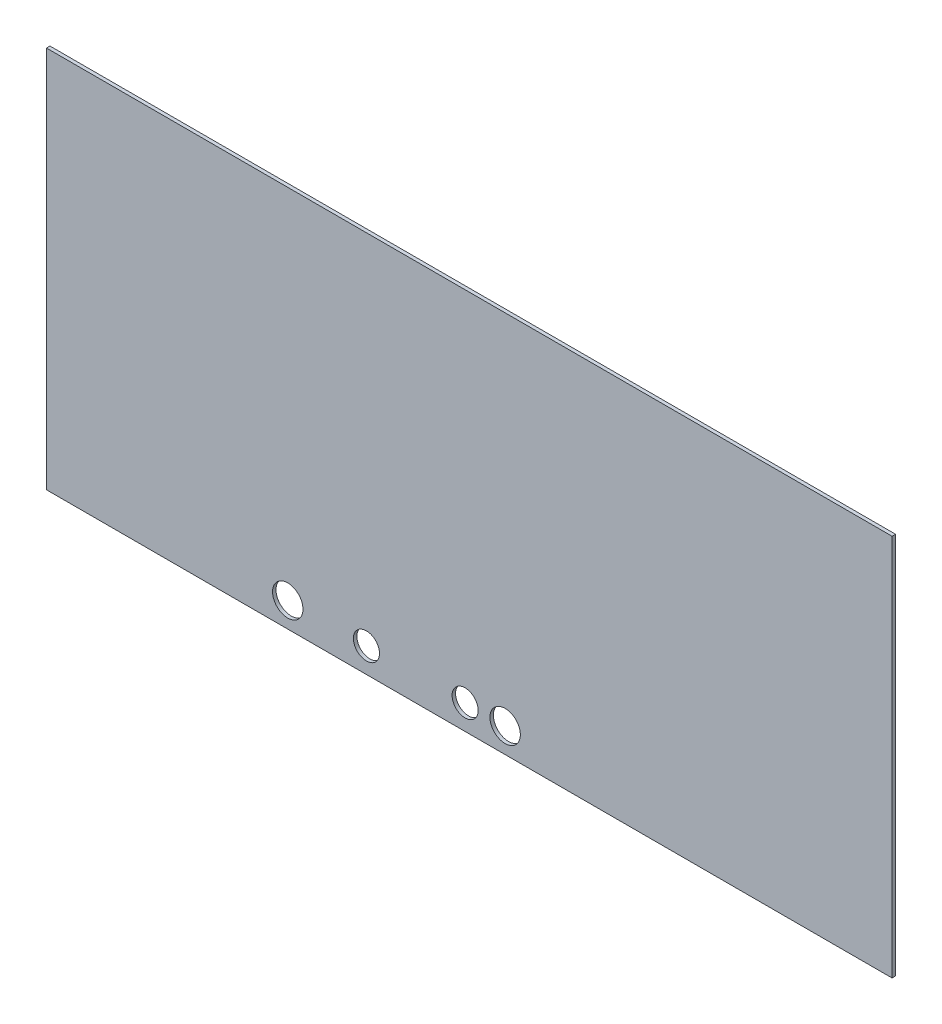
ISO-10303-21;
HEADER;
FILE_DESCRIPTION(('STEP AP214'),'2;1');
FILE_NAME('part.step','',(''),(''),'','','');
FILE_SCHEMA(('AUTOMOTIVE_DESIGN { 1 0 10303 214 1 1 1 1 }'));
ENDSEC;
DATA;
#1=APPLICATION_CONTEXT('core data for automotive mechanical design processes');
#2=APPLICATION_PROTOCOL_DEFINITION('international standard','automotive_design',2000,#1);
#3=PRODUCT_CONTEXT('',#1,'mechanical');
#4=PRODUCT('Part','Part','',(#3));
#5=PRODUCT_RELATED_PRODUCT_CATEGORY('part','',(#4));
#6=PRODUCT_DEFINITION_FORMATION('','',#4);
#7=PRODUCT_DEFINITION_CONTEXT('part definition',#1,'design');
#8=PRODUCT_DEFINITION('design','',#6,#7);
#9=PRODUCT_DEFINITION_SHAPE('','',#8);
#10=(LENGTH_UNIT() NAMED_UNIT(*) SI_UNIT(.MILLI.,.METRE.));
#11=(NAMED_UNIT(*) PLANE_ANGLE_UNIT() SI_UNIT($,.RADIAN.));
#12=(NAMED_UNIT(*) SI_UNIT($,.STERADIAN.) SOLID_ANGLE_UNIT());
#13=UNCERTAINTY_MEASURE_WITH_UNIT(LENGTH_MEASURE(1.E-05),#10,'distance_accuracy_value','');
#14=(GEOMETRIC_REPRESENTATION_CONTEXT(3) GLOBAL_UNCERTAINTY_ASSIGNED_CONTEXT((#13)) GLOBAL_UNIT_ASSIGNED_CONTEXT((#10,
#11,#12)) REPRESENTATION_CONTEXT('',''));
#15=CARTESIAN_POINT('',(0.,0.,0.));
#16=DIRECTION('',(0.,0.,1.));
#17=DIRECTION('',(1.,0.,0.));
#18=AXIS2_PLACEMENT_3D('',#15,#16,#17);
#19=CARTESIAN_POINT('',(0.,-7.00000000000001,-8.));
#20=DIRECTION('',(-1.,0.,0.));
#21=DIRECTION('',(0.,-1.,0.));
#22=AXIS2_PLACEMENT_3D('',#19,#20,#21);
#23=PLANE('',#22);
#24=DIRECTION('',(0.,-1.,0.));
#25=VECTOR('',#24,1.);
#26=CARTESIAN_POINT('',(0.,-7.00000000000001,0.));
#27=LINE('',#26,#25);
#28=CARTESIAN_POINT('',(0.,-7.00000000000001,0.));
#29=VERTEX_POINT('',#28);
#30=CARTESIAN_POINT('',(1.0862617108437E-13,-887.,0.));
#31=VERTEX_POINT('',#30);
#32=EDGE_CURVE('E103',#29,#31,#27,.T.);
#33=ORIENTED_EDGE('',*,*,#32,.F.);
#34=DIRECTION('',(0.,0.,1.));
#35=VECTOR('',#34,1.);
#36=CARTESIAN_POINT('',(0.,-7.00000000000001,-8.));
#37=LINE('',#36,#35);
#38=CARTESIAN_POINT('',(0.,-7.00000000000001,-8.));
#39=VERTEX_POINT('',#38);
#40=EDGE_CURVE('E11',#39,#29,#37,.T.);
#41=ORIENTED_EDGE('',*,*,#40,.F.);
#42=DIRECTION('',(0.,-1.,0.));
#43=VECTOR('',#42,1.);
#44=CARTESIAN_POINT('',(0.,-7.00000000000001,-8.));
#45=LINE('',#44,#43);
#46=CARTESIAN_POINT('',(1.0862617108437E-13,-887.,-8.));
#47=VERTEX_POINT('',#46);
#48=EDGE_CURVE('E96',#39,#47,#45,.T.);
#49=ORIENTED_EDGE('',*,*,#48,.T.);
#50=DIRECTION('',(0.,0.,1.));
#51=VECTOR('',#50,1.);
#52=CARTESIAN_POINT('',(1.0862617108437E-13,-887.,-8.));
#53=LINE('',#52,#51);
#54=EDGE_CURVE('E41',#47,#31,#53,.T.);
#55=ORIENTED_EDGE('',*,*,#54,.T.);
#56=EDGE_LOOP('',(#33,#41,#49,#55));
#57=FACE_BOUND('',#56,.T.);
#58=ADVANCED_FACE('F38',(#57),#23,.T.);
#59=CARTESIAN_POINT('',(1945.,-6.99999999999977,-8.));
#60=DIRECTION('',(0.,1.,0.));
#61=DIRECTION('',(-1.,0.,0.));
#62=AXIS2_PLACEMENT_3D('',#59,#60,#61);
#63=PLANE('',#62);
#64=DIRECTION('',(-1.,0.,0.));
#65=VECTOR('',#64,1.);
#66=CARTESIAN_POINT('',(1945.,-6.99999999999977,0.));
#67=LINE('',#66,#65);
#68=CARTESIAN_POINT('',(1945.,-6.99999999999977,0.));
#69=VERTEX_POINT('',#68);
#70=EDGE_CURVE('E98',#69,#29,#67,.T.);
#71=ORIENTED_EDGE('',*,*,#70,.F.);
#72=DIRECTION('',(0.,0.,1.));
#73=VECTOR('',#72,1.);
#74=CARTESIAN_POINT('',(1945.,-6.99999999999977,-8.));
#75=LINE('',#74,#73);
#76=CARTESIAN_POINT('',(1945.,-6.99999999999977,-8.));
#77=VERTEX_POINT('',#76);
#78=EDGE_CURVE('E47',#77,#69,#75,.T.);
#79=ORIENTED_EDGE('',*,*,#78,.F.);
#80=DIRECTION('',(-1.,0.,0.));
#81=VECTOR('',#80,1.);
#82=CARTESIAN_POINT('',(1945.,-6.99999999999977,-8.));
#83=LINE('',#82,#81);
#84=EDGE_CURVE('E93',#77,#39,#83,.T.);
#85=ORIENTED_EDGE('',*,*,#84,.T.);
#86=ORIENTED_EDGE('',*,*,#40,.T.);
#87=EDGE_LOOP('',(#71,#79,#85,#86));
#88=FACE_BOUND('',#87,.T.);
#89=ADVANCED_FACE('F114',(#88),#63,.T.);
#90=CARTESIAN_POINT('',(1945.,-887.,-8.));
#91=DIRECTION('',(1.,0.,0.));
#92=DIRECTION('',(0.,0.,-1.));
#93=AXIS2_PLACEMENT_3D('',#90,#91,#92);
#94=PLANE('',#93);
#95=DIRECTION('',(0.,1.,0.));
#96=VECTOR('',#95,1.);
#97=CARTESIAN_POINT('',(1945.,-887.,0.));
#98=LINE('',#97,#96);
#99=CARTESIAN_POINT('',(1945.,-887.,0.));
#100=VERTEX_POINT('',#99);
#101=EDGE_CURVE('E88',#100,#69,#98,.T.);
#102=ORIENTED_EDGE('',*,*,#101,.F.);
#103=DIRECTION('',(0.,0.,1.));
#104=VECTOR('',#103,1.);
#105=CARTESIAN_POINT('',(1945.,-887.,-8.));
#106=LINE('',#105,#104);
#107=CARTESIAN_POINT('',(1945.,-887.,-8.));
#108=VERTEX_POINT('',#107);
#109=EDGE_CURVE('E83',#108,#100,#106,.T.);
#110=ORIENTED_EDGE('',*,*,#109,.F.);
#111=DIRECTION('',(0.,1.,0.));
#112=VECTOR('',#111,1.);
#113=CARTESIAN_POINT('',(1945.,-887.,-8.));
#114=LINE('',#113,#112);
#115=EDGE_CURVE('E86',#108,#77,#114,.T.);
#116=ORIENTED_EDGE('',*,*,#115,.T.);
#117=ORIENTED_EDGE('',*,*,#78,.T.);
#118=EDGE_LOOP('',(#102,#110,#116,#117));
#119=FACE_BOUND('',#118,.T.);
#120=ADVANCED_FACE('F85',(#119),#94,.T.);
#121=CARTESIAN_POINT('',(1.0862617108437E-13,-887.,-8.));
#122=DIRECTION('',(0.,-1.,0.));
#123=DIRECTION('',(0.,0.,-1.));
#124=AXIS2_PLACEMENT_3D('',#121,#122,#123);
#125=PLANE('',#124);
#126=DIRECTION('',(1.,0.,0.));
#127=VECTOR('',#126,1.);
#128=CARTESIAN_POINT('',(1.0862617108437E-13,-887.,0.));
#129=LINE('',#128,#127);
#130=EDGE_CURVE('E106',#31,#100,#129,.T.);
#131=ORIENTED_EDGE('',*,*,#130,.F.);
#132=ORIENTED_EDGE('',*,*,#54,.F.);
#133=DIRECTION('',(1.,0.,0.));
#134=VECTOR('',#133,1.);
#135=CARTESIAN_POINT('',(1.0862617108437E-13,-887.,-8.));
#136=LINE('',#135,#134);
#137=EDGE_CURVE('E92',#47,#108,#136,.T.);
#138=ORIENTED_EDGE('',*,*,#137,.T.);
#139=ORIENTED_EDGE('',*,*,#109,.T.);
#140=EDGE_LOOP('',(#131,#132,#138,#139));
#141=FACE_BOUND('',#140,.T.);
#142=ADVANCED_FACE('F95',(#141),#125,.T.);
#143=CARTESIAN_POINT('',(0.,0.,-8.));
#144=DIRECTION('',(0.,0.,1.));
#145=DIRECTION('',(1.,0.,0.));
#146=AXIS2_PLACEMENT_3D('',#143,#144,#145);
#147=PLANE('',#146);
#148=CARTESIAN_POINT('',(1055.,-830.,-8.));
#149=DIRECTION('',(0.,0.,1.));
#150=DIRECTION('',(1.,0.,0.));
#151=AXIS2_PLACEMENT_3D('',#148,#149,#150);
#152=CIRCLE('',#151,34.9999999999999);
#153=CARTESIAN_POINT('',(1090.,-830.,-8.));
#154=VERTEX_POINT('',#153);
#155=EDGE_CURVE('E155',#154,#154,#152,.T.);
#156=ORIENTED_EDGE('',*,*,#155,.T.);
#157=EDGE_LOOP('',(#156));
#158=FACE_BOUND('',#157,.T.);
#159=CARTESIAN_POINT('',(963.,-830.,-8.));
#160=DIRECTION('',(0.,0.,1.));
#161=DIRECTION('',(1.,0.,0.));
#162=AXIS2_PLACEMENT_3D('',#159,#160,#161);
#163=CIRCLE('',#162,30.0000000000001);
#164=CARTESIAN_POINT('',(993.,-830.,-8.));
#165=VERTEX_POINT('',#164);
#166=EDGE_CURVE('E163',#165,#165,#163,.T.);
#167=ORIENTED_EDGE('',*,*,#166,.T.);
#168=EDGE_LOOP('',(#167));
#169=FACE_BOUND('',#168,.T.);
#170=CARTESIAN_POINT('',(736.,-830.,-8.));
#171=DIRECTION('',(0.,0.,1.));
#172=DIRECTION('',(1.,0.,0.));
#173=AXIS2_PLACEMENT_3D('',#170,#171,#172);
#174=CIRCLE('',#173,30.0000000000001);
#175=CARTESIAN_POINT('',(766.,-830.,-8.));
#176=VERTEX_POINT('',#175);
#177=EDGE_CURVE('E169',#176,#176,#174,.T.);
#178=ORIENTED_EDGE('',*,*,#177,.T.);
#179=EDGE_LOOP('',(#178));
#180=FACE_BOUND('',#179,.T.);
#181=CARTESIAN_POINT('',(555.,-830.,-8.));
#182=DIRECTION('',(0.,0.,1.));
#183=DIRECTION('',(1.,0.,0.));
#184=AXIS2_PLACEMENT_3D('',#181,#182,#183);
#185=CIRCLE('',#184,35.);
#186=CARTESIAN_POINT('',(590.,-830.,-8.));
#187=VERTEX_POINT('',#186);
#188=EDGE_CURVE('E107',#187,#187,#185,.T.);
#189=ORIENTED_EDGE('',*,*,#188,.T.);
#190=EDGE_LOOP('',(#189));
#191=FACE_BOUND('',#190,.T.);
#192=ORIENTED_EDGE('',*,*,#48,.F.);
#193=ORIENTED_EDGE('',*,*,#84,.F.);
#194=ORIENTED_EDGE('',*,*,#115,.F.);
#195=ORIENTED_EDGE('',*,*,#137,.F.);
#196=EDGE_LOOP('',(#192,#193,#194,#195));
#197=FACE_BOUND('',#196,.T.);
#198=ADVANCED_FACE('F91',(#158,#169,#180,#191,#197),#147,.F.);
#199=CARTESIAN_POINT('',(0.,0.,0.));
#200=DIRECTION('',(0.,0.,1.));
#201=DIRECTION('',(1.,0.,0.));
#202=AXIS2_PLACEMENT_3D('',#199,#200,#201);
#203=PLANE('',#202);
#204=CARTESIAN_POINT('',(1055.,-830.,0.));
#205=DIRECTION('',(0.,0.,1.));
#206=DIRECTION('',(1.,0.,0.));
#207=AXIS2_PLACEMENT_3D('',#204,#205,#206);
#208=CIRCLE('',#207,34.9999999999999);
#209=CARTESIAN_POINT('',(1090.,-830.,0.));
#210=VERTEX_POINT('',#209);
#211=EDGE_CURVE('E158',#210,#210,#208,.T.);
#212=ORIENTED_EDGE('',*,*,#211,.F.);
#213=EDGE_LOOP('',(#212));
#214=FACE_BOUND('',#213,.T.);
#215=CARTESIAN_POINT('',(963.,-830.,0.));
#216=DIRECTION('',(0.,0.,1.));
#217=DIRECTION('',(1.,0.,0.));
#218=AXIS2_PLACEMENT_3D('',#215,#216,#217);
#219=CIRCLE('',#218,30.0000000000001);
#220=CARTESIAN_POINT('',(993.,-830.,0.));
#221=VERTEX_POINT('',#220);
#222=EDGE_CURVE('E160',#221,#221,#219,.T.);
#223=ORIENTED_EDGE('',*,*,#222,.F.);
#224=EDGE_LOOP('',(#223));
#225=FACE_BOUND('',#224,.T.);
#226=CARTESIAN_POINT('',(736.,-830.,0.));
#227=DIRECTION('',(0.,0.,1.));
#228=DIRECTION('',(1.,0.,0.));
#229=AXIS2_PLACEMENT_3D('',#226,#227,#228);
#230=CIRCLE('',#229,30.0000000000001);
#231=CARTESIAN_POINT('',(766.,-830.,0.));
#232=VERTEX_POINT('',#231);
#233=EDGE_CURVE('E166',#232,#232,#230,.T.);
#234=ORIENTED_EDGE('',*,*,#233,.F.);
#235=EDGE_LOOP('',(#234));
#236=FACE_BOUND('',#235,.T.);
#237=CARTESIAN_POINT('',(555.,-830.,0.));
#238=DIRECTION('',(0.,0.,1.));
#239=DIRECTION('',(1.,0.,0.));
#240=AXIS2_PLACEMENT_3D('',#237,#238,#239);
#241=CIRCLE('',#240,35.);
#242=CARTESIAN_POINT('',(590.,-830.,0.));
#243=VERTEX_POINT('',#242);
#244=EDGE_CURVE('E172',#243,#243,#241,.T.);
#245=ORIENTED_EDGE('',*,*,#244,.F.);
#246=EDGE_LOOP('',(#245));
#247=FACE_BOUND('',#246,.T.);
#248=ORIENTED_EDGE('',*,*,#32,.T.);
#249=ORIENTED_EDGE('',*,*,#130,.T.);
#250=ORIENTED_EDGE('',*,*,#101,.T.);
#251=ORIENTED_EDGE('',*,*,#70,.T.);
#252=EDGE_LOOP('',(#248,#249,#250,#251));
#253=FACE_BOUND('',#252,.T.);
#254=ADVANCED_FACE('F113',(#214,#225,#236,#247,#253),#203,.T.);
#255=CARTESIAN_POINT('',(555.,-830.,-8.));
#256=DIRECTION('',(0.,0.,1.));
#257=DIRECTION('',(1.,0.,0.));
#258=AXIS2_PLACEMENT_3D('',#255,#256,#257);
#259=CYLINDRICAL_SURFACE('',#258,35.);
#260=ORIENTED_EDGE('',*,*,#188,.F.);
#261=EDGE_LOOP('',(#260));
#262=FACE_BOUND('',#261,.T.);
#263=ORIENTED_EDGE('',*,*,#244,.T.);
#264=EDGE_LOOP('',(#263));
#265=FACE_BOUND('',#264,.T.);
#266=ADVANCED_FACE('F132',(#262,#265),#259,.F.);
#267=CARTESIAN_POINT('',(736.,-830.,-8.));
#268=DIRECTION('',(0.,0.,1.));
#269=DIRECTION('',(1.,0.,0.));
#270=AXIS2_PLACEMENT_3D('',#267,#268,#269);
#271=CYLINDRICAL_SURFACE('',#270,30.0000000000001);
#272=ORIENTED_EDGE('',*,*,#177,.F.);
#273=EDGE_LOOP('',(#272));
#274=FACE_BOUND('',#273,.T.);
#275=ORIENTED_EDGE('',*,*,#233,.T.);
#276=EDGE_LOOP('',(#275));
#277=FACE_BOUND('',#276,.T.);
#278=ADVANCED_FACE('F139',(#274,#277),#271,.F.);
#279=CARTESIAN_POINT('',(963.,-830.,-8.));
#280=DIRECTION('',(0.,0.,1.));
#281=DIRECTION('',(1.,0.,0.));
#282=AXIS2_PLACEMENT_3D('',#279,#280,#281);
#283=CYLINDRICAL_SURFACE('',#282,30.0000000000001);
#284=ORIENTED_EDGE('',*,*,#166,.F.);
#285=EDGE_LOOP('',(#284));
#286=FACE_BOUND('',#285,.T.);
#287=ORIENTED_EDGE('',*,*,#222,.T.);
#288=EDGE_LOOP('',(#287));
#289=FACE_BOUND('',#288,.T.);
#290=ADVANCED_FACE('F143',(#286,#289),#283,.F.);
#291=CARTESIAN_POINT('',(1055.,-830.,-8.));
#292=DIRECTION('',(0.,0.,1.));
#293=DIRECTION('',(1.,0.,0.));
#294=AXIS2_PLACEMENT_3D('',#291,#292,#293);
#295=CYLINDRICAL_SURFACE('',#294,34.9999999999999);
#296=ORIENTED_EDGE('',*,*,#155,.F.);
#297=EDGE_LOOP('',(#296));
#298=FACE_BOUND('',#297,.T.);
#299=ORIENTED_EDGE('',*,*,#211,.T.);
#300=EDGE_LOOP('',(#299));
#301=FACE_BOUND('',#300,.T.);
#302=ADVANCED_FACE('F147',(#298,#301),#295,.F.);
#303=CLOSED_SHELL('',(#58,#89,#120,#142,#198,#254,#266,#278,#290,#302));
#304=MANIFOLD_SOLID_BREP('B2',#303);
#305=ADVANCED_BREP_SHAPE_REPRESENTATION('',(#18,#304),#14);
#306=SHAPE_DEFINITION_REPRESENTATION(#9,#305);
ENDSEC;
END-ISO-10303-21;
